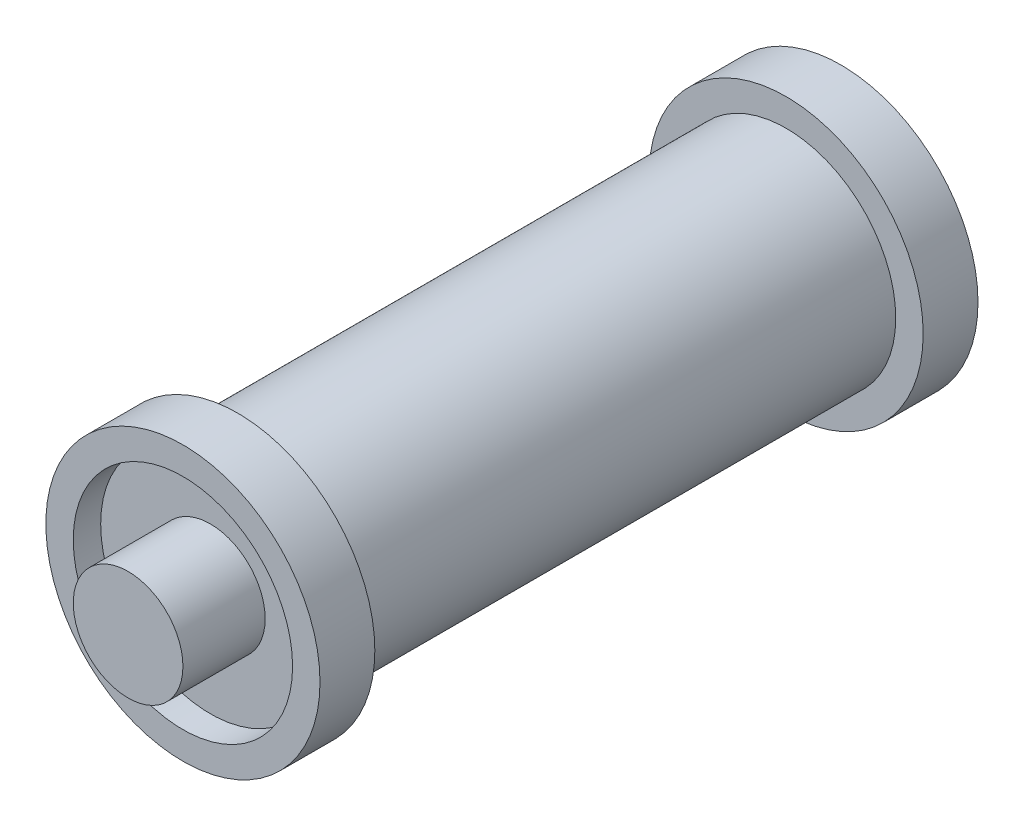
ISO-10303-21;
HEADER;
FILE_DESCRIPTION(('STEP AP214'),'2;1');
FILE_NAME('part.step','',(''),(''),'','','');
FILE_SCHEMA(('AUTOMOTIVE_DESIGN { 1 0 10303 214 1 1 1 1 }'));
ENDSEC;
DATA;
#1=APPLICATION_CONTEXT('core data for automotive mechanical design processes');
#2=APPLICATION_PROTOCOL_DEFINITION('international standard','automotive_design',2000,#1);
#3=PRODUCT_CONTEXT('',#1,'mechanical');
#4=PRODUCT('Part','Part','',(#3));
#5=PRODUCT_RELATED_PRODUCT_CATEGORY('part','',(#4));
#6=PRODUCT_DEFINITION_FORMATION('','',#4);
#7=PRODUCT_DEFINITION_CONTEXT('part definition',#1,'design');
#8=PRODUCT_DEFINITION('design','',#6,#7);
#9=PRODUCT_DEFINITION_SHAPE('','',#8);
#10=(LENGTH_UNIT() NAMED_UNIT(*) SI_UNIT(.MILLI.,.METRE.));
#11=(NAMED_UNIT(*) PLANE_ANGLE_UNIT() SI_UNIT($,.RADIAN.));
#12=(NAMED_UNIT(*) SI_UNIT($,.STERADIAN.) SOLID_ANGLE_UNIT());
#13=UNCERTAINTY_MEASURE_WITH_UNIT(LENGTH_MEASURE(1.E-05),#10,'distance_accuracy_value','');
#14=(GEOMETRIC_REPRESENTATION_CONTEXT(3) GLOBAL_UNCERTAINTY_ASSIGNED_CONTEXT((#13)) GLOBAL_UNIT_ASSIGNED_CONTEXT((#10,
#11,#12)) REPRESENTATION_CONTEXT('',''));
#15=CARTESIAN_POINT('',(0.,0.,0.));
#16=DIRECTION('',(0.,0.,1.));
#17=DIRECTION('',(1.,0.,0.));
#18=AXIS2_PLACEMENT_3D('',#15,#16,#17);
#19=CARTESIAN_POINT('',(0.,0.,1.));
#20=DIRECTION('',(0.,0.,1.));
#21=DIRECTION('',(1.,0.,0.));
#22=AXIS2_PLACEMENT_3D('',#19,#20,#21);
#23=PLANE('',#22);
#24=CARTESIAN_POINT('',(0.,0.,1.));
#25=DIRECTION('',(0.,0.,1.));
#26=DIRECTION('',(1.,0.,0.));
#27=AXIS2_PLACEMENT_3D('',#24,#25,#26);
#28=CIRCLE('',#27,4.);
#29=CARTESIAN_POINT('',(4.,0.,1.));
#30=VERTEX_POINT('',#29);
#31=EDGE_CURVE('E62',#30,#30,#28,.T.);
#32=ORIENTED_EDGE('',*,*,#31,.T.);
#33=EDGE_LOOP('',(#32));
#34=FACE_BOUND('',#33,.T.);
#35=CARTESIAN_POINT('',(0.,0.,1.));
#36=DIRECTION('',(0.,0.,1.));
#37=DIRECTION('',(1.,0.,0.));
#38=AXIS2_PLACEMENT_3D('',#35,#36,#37);
#39=CIRCLE('',#38,2.);
#40=CARTESIAN_POINT('',(2.,0.,1.));
#41=VERTEX_POINT('',#40);
#42=EDGE_CURVE('E81',#41,#41,#39,.T.);
#43=ORIENTED_EDGE('',*,*,#42,.F.);
#44=EDGE_LOOP('',(#43));
#45=FACE_BOUND('',#44,.T.);
#46=ADVANCED_FACE('F42',(#34,#45),#23,.T.);
#47=CARTESIAN_POINT('',(0.,0.,0.));
#48=DIRECTION('',(0.,0.,1.));
#49=DIRECTION('',(1.,0.,0.));
#50=AXIS2_PLACEMENT_3D('',#47,#48,#49);
#51=PLANE('',#50);
#52=CARTESIAN_POINT('',(0.,0.,0.));
#53=DIRECTION('',(0.,0.,1.));
#54=DIRECTION('',(1.,0.,0.));
#55=AXIS2_PLACEMENT_3D('',#52,#53,#54);
#56=CIRCLE('',#55,5.);
#57=CARTESIAN_POINT('',(5.,0.,0.));
#58=VERTEX_POINT('',#57);
#59=EDGE_CURVE('E53',#58,#58,#56,.T.);
#60=ORIENTED_EDGE('',*,*,#59,.F.);
#61=EDGE_LOOP('',(#60));
#62=FACE_BOUND('',#61,.T.);
#63=CARTESIAN_POINT('',(0.,0.,0.));
#64=DIRECTION('',(0.,0.,1.));
#65=DIRECTION('',(1.,0.,0.));
#66=AXIS2_PLACEMENT_3D('',#63,#64,#65);
#67=CIRCLE('',#66,4.);
#68=CARTESIAN_POINT('',(4.,0.,0.));
#69=VERTEX_POINT('',#68);
#70=EDGE_CURVE('E12',#69,#69,#67,.F.);
#71=ORIENTED_EDGE('',*,*,#70,.F.);
#72=EDGE_LOOP('',(#71));
#73=FACE_BOUND('',#72,.T.);
#74=ADVANCED_FACE('F97',(#62,#73),#51,.F.);
#75=CARTESIAN_POINT('',(0.,0.,2.));
#76=DIRECTION('',(0.,0.,-1.));
#77=DIRECTION('',(-1.,0.,0.));
#78=AXIS2_PLACEMENT_3D('',#75,#76,#77);
#79=CYLINDRICAL_SURFACE('',#78,5.);
#80=CARTESIAN_POINT('',(0.,0.,2.));
#81=DIRECTION('',(0.,0.,1.));
#82=DIRECTION('',(1.,0.,0.));
#83=AXIS2_PLACEMENT_3D('',#80,#81,#82);
#84=CIRCLE('',#83,5.);
#85=CARTESIAN_POINT('',(5.,0.,2.));
#86=VERTEX_POINT('',#85);
#87=EDGE_CURVE('E49',#86,#86,#84,.T.);
#88=ORIENTED_EDGE('',*,*,#87,.F.);
#89=EDGE_LOOP('',(#88));
#90=FACE_BOUND('',#89,.T.);
#91=ORIENTED_EDGE('',*,*,#59,.T.);
#92=EDGE_LOOP('',(#91));
#93=FACE_BOUND('',#92,.T.);
#94=ADVANCED_FACE('F44',(#90,#93),#79,.T.);
#95=CARTESIAN_POINT('',(0.,0.,2.));
#96=DIRECTION('',(0.,0.,1.));
#97=DIRECTION('',(1.,0.,0.));
#98=AXIS2_PLACEMENT_3D('',#95,#96,#97);
#99=PLANE('',#98);
#100=CARTESIAN_POINT('',(0.,0.,2.));
#101=DIRECTION('',(0.,0.,1.));
#102=DIRECTION('',(1.,0.,0.));
#103=AXIS2_PLACEMENT_3D('',#100,#101,#102);
#104=CIRCLE('',#103,4.);
#105=CARTESIAN_POINT('',(4.,0.,2.));
#106=VERTEX_POINT('',#105);
#107=EDGE_CURVE('E58',#106,#106,#104,.T.);
#108=ORIENTED_EDGE('',*,*,#107,.F.);
#109=EDGE_LOOP('',(#108));
#110=FACE_BOUND('',#109,.T.);
#111=ORIENTED_EDGE('',*,*,#87,.T.);
#112=EDGE_LOOP('',(#111));
#113=FACE_BOUND('',#112,.T.);
#114=ADVANCED_FACE('F108',(#110,#113),#99,.T.);
#115=CARTESIAN_POINT('',(0.,0.,2.));
#116=DIRECTION('',(0.,0.,-1.));
#117=DIRECTION('',(-1.,0.,0.));
#118=AXIS2_PLACEMENT_3D('',#115,#116,#117);
#119=CYLINDRICAL_SURFACE('',#118,4.);
#120=ORIENTED_EDGE('',*,*,#107,.T.);
#121=EDGE_LOOP('',(#120));
#122=FACE_BOUND('',#121,.T.);
#123=ORIENTED_EDGE('',*,*,#31,.F.);
#124=EDGE_LOOP('',(#123));
#125=FACE_BOUND('',#124,.T.);
#126=ADVANCED_FACE('F106',(#122,#125),#119,.F.);
#127=CARTESIAN_POINT('',(0.,0.,-10.));
#128=DIRECTION('',(0.,0.,1.));
#129=DIRECTION('',(1.,0.,0.));
#130=AXIS2_PLACEMENT_3D('',#127,#128,#129);
#131=CYLINDRICAL_SURFACE('',#130,4.);
#132=ORIENTED_EDGE('',*,*,#70,.T.);
#133=EDGE_LOOP('',(#132));
#134=FACE_BOUND('',#133,.T.);
#135=CARTESIAN_POINT('',(0.,0.,-20.));
#136=DIRECTION('',(0.,0.,1.));
#137=DIRECTION('',(1.,0.,0.));
#138=AXIS2_PLACEMENT_3D('',#135,#136,#137);
#139=CIRCLE('',#138,4.);
#140=CARTESIAN_POINT('',(4.,0.,-20.));
#141=VERTEX_POINT('',#140);
#142=EDGE_CURVE('E65',#141,#141,#139,.F.);
#143=ORIENTED_EDGE('',*,*,#142,.F.);
#144=EDGE_LOOP('',(#143));
#145=FACE_BOUND('',#144,.T.);
#146=ADVANCED_FACE('F115',(#134,#145),#131,.T.);
#147=CARTESIAN_POINT('',(0.,0.,-20.));
#148=DIRECTION('',(0.,0.,-1.));
#149=DIRECTION('',(1.,0.,0.));
#150=AXIS2_PLACEMENT_3D('',#147,#148,#149);
#151=PLANE('',#150);
#152=CARTESIAN_POINT('',(0.,0.,-20.));
#153=DIRECTION('',(0.,0.,1.));
#154=DIRECTION('',(1.,0.,0.));
#155=AXIS2_PLACEMENT_3D('',#152,#153,#154);
#156=CIRCLE('',#155,5.);
#157=CARTESIAN_POINT('',(5.,0.,-20.));
#158=VERTEX_POINT('',#157);
#159=EDGE_CURVE('E69',#158,#158,#156,.T.);
#160=ORIENTED_EDGE('',*,*,#159,.T.);
#161=EDGE_LOOP('',(#160));
#162=FACE_BOUND('',#161,.T.);
#163=ORIENTED_EDGE('',*,*,#142,.T.);
#164=EDGE_LOOP('',(#163));
#165=FACE_BOUND('',#164,.T.);
#166=ADVANCED_FACE('F140',(#162,#165),#151,.F.);
#167=CARTESIAN_POINT('',(0.,0.,-22.));
#168=DIRECTION('',(0.,0.,1.));
#169=DIRECTION('',(-1.,0.,0.));
#170=AXIS2_PLACEMENT_3D('',#167,#168,#169);
#171=CYLINDRICAL_SURFACE('',#170,5.);
#172=CARTESIAN_POINT('',(0.,0.,-22.));
#173=DIRECTION('',(0.,0.,1.));
#174=DIRECTION('',(1.,0.,0.));
#175=AXIS2_PLACEMENT_3D('',#172,#173,#174);
#176=CIRCLE('',#175,5.);
#177=CARTESIAN_POINT('',(5.,0.,-22.));
#178=VERTEX_POINT('',#177);
#179=EDGE_CURVE('E68',#178,#178,#176,.T.);
#180=ORIENTED_EDGE('',*,*,#179,.T.);
#181=EDGE_LOOP('',(#180));
#182=FACE_BOUND('',#181,.T.);
#183=ORIENTED_EDGE('',*,*,#159,.F.);
#184=EDGE_LOOP('',(#183));
#185=FACE_BOUND('',#184,.T.);
#186=ADVANCED_FACE('F155',(#182,#185),#171,.T.);
#187=CARTESIAN_POINT('',(0.,0.,-22.));
#188=DIRECTION('',(0.,0.,-1.));
#189=DIRECTION('',(1.,0.,0.));
#190=AXIS2_PLACEMENT_3D('',#187,#188,#189);
#191=PLANE('',#190);
#192=CARTESIAN_POINT('',(0.,0.,-22.));
#193=DIRECTION('',(0.,0.,1.));
#194=DIRECTION('',(1.,0.,0.));
#195=AXIS2_PLACEMENT_3D('',#192,#193,#194);
#196=CIRCLE('',#195,4.);
#197=CARTESIAN_POINT('',(4.,0.,-22.));
#198=VERTEX_POINT('',#197);
#199=EDGE_CURVE('E72',#198,#198,#196,.T.);
#200=ORIENTED_EDGE('',*,*,#199,.T.);
#201=EDGE_LOOP('',(#200));
#202=FACE_BOUND('',#201,.T.);
#203=ORIENTED_EDGE('',*,*,#179,.F.);
#204=EDGE_LOOP('',(#203));
#205=FACE_BOUND('',#204,.T.);
#206=ADVANCED_FACE('F164',(#202,#205),#191,.T.);
#207=CARTESIAN_POINT('',(0.,0.,-22.));
#208=DIRECTION('',(0.,0.,1.));
#209=DIRECTION('',(-1.,0.,0.));
#210=AXIS2_PLACEMENT_3D('',#207,#208,#209);
#211=CYLINDRICAL_SURFACE('',#210,4.);
#212=ORIENTED_EDGE('',*,*,#199,.F.);
#213=EDGE_LOOP('',(#212));
#214=FACE_BOUND('',#213,.T.);
#215=CARTESIAN_POINT('',(0.,0.,-21.));
#216=DIRECTION('',(0.,0.,1.));
#217=DIRECTION('',(1.,0.,0.));
#218=AXIS2_PLACEMENT_3D('',#215,#216,#217);
#219=CIRCLE('',#218,4.);
#220=CARTESIAN_POINT('',(4.,0.,-21.));
#221=VERTEX_POINT('',#220);
#222=EDGE_CURVE('E77',#221,#221,#219,.T.);
#223=ORIENTED_EDGE('',*,*,#222,.T.);
#224=EDGE_LOOP('',(#223));
#225=FACE_BOUND('',#224,.T.);
#226=ADVANCED_FACE('F173',(#214,#225),#211,.F.);
#227=CARTESIAN_POINT('',(0.,0.,-21.));
#228=DIRECTION('',(0.,0.,-1.));
#229=DIRECTION('',(1.,0.,0.));
#230=AXIS2_PLACEMENT_3D('',#227,#228,#229);
#231=PLANE('',#230);
#232=ORIENTED_EDGE('',*,*,#222,.F.);
#233=EDGE_LOOP('',(#232));
#234=FACE_BOUND('',#233,.T.);
#235=ADVANCED_FACE('F92',(#234),#231,.T.);
#236=CARTESIAN_POINT('',(0.,0.,4.));
#237=DIRECTION('',(0.,0.,-1.));
#238=DIRECTION('',(-1.,0.,0.));
#239=AXIS2_PLACEMENT_3D('',#236,#237,#238);
#240=CYLINDRICAL_SURFACE('',#239,2.);
#241=CARTESIAN_POINT('',(0.,0.,4.));
#242=DIRECTION('',(0.,0.,1.));
#243=DIRECTION('',(1.,0.,0.));
#244=AXIS2_PLACEMENT_3D('',#241,#242,#243);
#245=CIRCLE('',#244,2.);
#246=CARTESIAN_POINT('',(2.,0.,4.));
#247=VERTEX_POINT('',#246);
#248=EDGE_CURVE('E80',#247,#247,#245,.T.);
#249=ORIENTED_EDGE('',*,*,#248,.F.);
#250=EDGE_LOOP('',(#249));
#251=FACE_BOUND('',#250,.T.);
#252=ORIENTED_EDGE('',*,*,#42,.T.);
#253=EDGE_LOOP('',(#252));
#254=FACE_BOUND('',#253,.T.);
#255=ADVANCED_FACE('F89',(#251,#254),#240,.T.);
#256=CARTESIAN_POINT('',(0.,0.,4.));
#257=DIRECTION('',(0.,0.,1.));
#258=DIRECTION('',(1.,0.,0.));
#259=AXIS2_PLACEMENT_3D('',#256,#257,#258);
#260=PLANE('',#259);
#261=ORIENTED_EDGE('',*,*,#248,.T.);
#262=EDGE_LOOP('',(#261));
#263=FACE_BOUND('',#262,.T.);
#264=ADVANCED_FACE('F87',(#263),#260,.T.);
#265=CLOSED_SHELL('',(#46,#74,#94,#114,#126,#146,#166,#186,#206,#226,#235,#255,#264));
#266=MANIFOLD_SOLID_BREP('B2',#265);
#267=ADVANCED_BREP_SHAPE_REPRESENTATION('',(#18,#266),#14);
#268=SHAPE_DEFINITION_REPRESENTATION(#9,#267);
ENDSEC;
END-ISO-10303-21;
